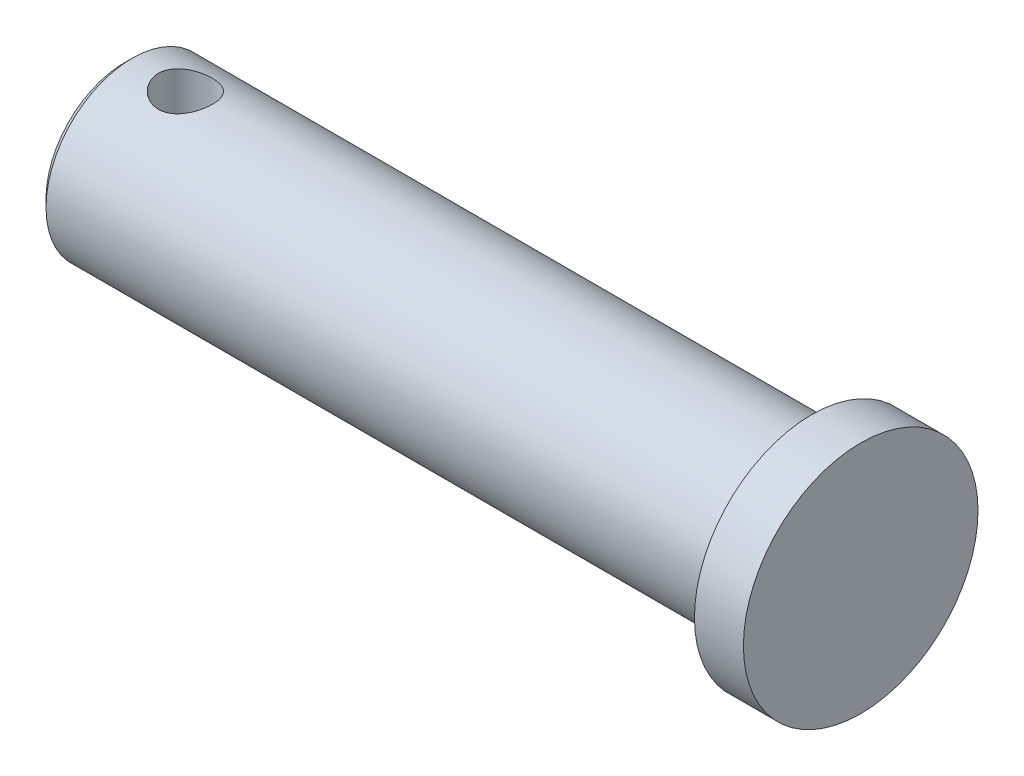
ISO-10303-21;
HEADER;
FILE_DESCRIPTION(('STEP AP214'),'2;1');
FILE_NAME('part.step','',(''),(''),'','','');
FILE_SCHEMA(('AUTOMOTIVE_DESIGN { 1 0 10303 214 1 1 1 1 }'));
ENDSEC;
DATA;
#1=APPLICATION_CONTEXT('core data for automotive mechanical design processes');
#2=APPLICATION_PROTOCOL_DEFINITION('international standard','automotive_design',2000,#1);
#3=PRODUCT_CONTEXT('',#1,'mechanical');
#4=PRODUCT('Part','Part','',(#3));
#5=PRODUCT_RELATED_PRODUCT_CATEGORY('part','',(#4));
#6=PRODUCT_DEFINITION_FORMATION('','',#4);
#7=PRODUCT_DEFINITION_CONTEXT('part definition',#1,'design');
#8=PRODUCT_DEFINITION('design','',#6,#7);
#9=PRODUCT_DEFINITION_SHAPE('','',#8);
#10=(LENGTH_UNIT() NAMED_UNIT(*) SI_UNIT(.MILLI.,.METRE.));
#11=(NAMED_UNIT(*) PLANE_ANGLE_UNIT() SI_UNIT($,.RADIAN.));
#12=(NAMED_UNIT(*) SI_UNIT($,.STERADIAN.) SOLID_ANGLE_UNIT());
#13=UNCERTAINTY_MEASURE_WITH_UNIT(LENGTH_MEASURE(1.E-05),#10,'distance_accuracy_value','');
#14=(GEOMETRIC_REPRESENTATION_CONTEXT(3) GLOBAL_UNCERTAINTY_ASSIGNED_CONTEXT((#13)) GLOBAL_UNIT_ASSIGNED_CONTEXT((#10,
#11,#12)) REPRESENTATION_CONTEXT('',''));
#15=CARTESIAN_POINT('',(0.,0.,0.));
#16=DIRECTION('',(0.,0.,1.));
#17=DIRECTION('',(1.,0.,0.));
#18=AXIS2_PLACEMENT_3D('',#15,#16,#17);
#19=CARTESIAN_POINT('',(24.6253,0.,0.));
#20=DIRECTION('',(1.,0.,0.));
#21=DIRECTION('',(0.,1.,0.));
#22=AXIS2_PLACEMENT_3D('',#19,#20,#21);
#23=PLANE('',#22);
#24=CARTESIAN_POINT('',(24.6253,0.,0.));
#25=DIRECTION('',(1.,0.,0.));
#26=DIRECTION('',(0.,0.,-1.));
#27=AXIS2_PLACEMENT_3D('',#24,#25,#26);
#28=CIRCLE('',#27,7.8486);
#29=CARTESIAN_POINT('',(24.6253,0.,-7.8486));
#30=VERTEX_POINT('',#29);
#31=EDGE_CURVE('E10',#30,#30,#28,.T.);
#32=ORIENTED_EDGE('',*,*,#31,.T.);
#33=EDGE_LOOP('',(#32));
#34=FACE_BOUND('',#33,.T.);
#35=ADVANCED_FACE('F15',(#34),#23,.T.);
#36=CARTESIAN_POINT('',(24.6253,0.,0.));
#37=DIRECTION('',(-1.,0.,0.));
#38=DIRECTION('',(0.,0.,-1.));
#39=AXIS2_PLACEMENT_3D('',#36,#37,#38);
#40=CYLINDRICAL_SURFACE('',#39,7.8486);
#41=ORIENTED_EDGE('',*,*,#31,.F.);
#42=EDGE_LOOP('',(#41));
#43=FACE_BOUND('',#42,.T.);
#44=CARTESIAN_POINT('',(21.3487,0.,0.));
#45=DIRECTION('',(-1.,0.,0.));
#46=DIRECTION('',(0.,0.,-1.));
#47=AXIS2_PLACEMENT_3D('',#44,#45,#46);
#48=CIRCLE('',#47,7.8486);
#49=CARTESIAN_POINT('',(21.3487,0.,-7.8486));
#50=VERTEX_POINT('',#49);
#51=EDGE_CURVE('E29',#50,#50,#48,.T.);
#52=ORIENTED_EDGE('',*,*,#51,.F.);
#53=EDGE_LOOP('',(#52));
#54=FACE_BOUND('',#53,.T.);
#55=ADVANCED_FACE('F17',(#43,#54),#40,.T.);
#56=CARTESIAN_POINT('',(21.3487,0.,0.));
#57=DIRECTION('',(1.,0.,0.));
#58=DIRECTION('',(0.,1.,0.));
#59=AXIS2_PLACEMENT_3D('',#56,#57,#58);
#60=PLANE('',#59);
#61=CARTESIAN_POINT('',(21.3487,0.,0.));
#62=DIRECTION('',(-1.,0.,0.));
#63=DIRECTION('',(0.,1.,0.));
#64=AXIS2_PLACEMENT_3D('',#61,#62,#63);
#65=CIRCLE('',#64,5.77215);
#66=CARTESIAN_POINT('',(21.3487,5.77215,0.));
#67=VERTEX_POINT('',#66);
#68=EDGE_CURVE('E83',#67,#67,#65,.T.);
#69=ORIENTED_EDGE('',*,*,#68,.F.);
#70=EDGE_LOOP('',(#69));
#71=FACE_BOUND('',#70,.T.);
#72=ORIENTED_EDGE('',*,*,#51,.T.);
#73=EDGE_LOOP('',(#72));
#74=FACE_BOUND('',#73,.T.);
#75=ADVANCED_FACE('F72',(#71,#74),#60,.F.);
#76=CARTESIAN_POINT('',(-20.5613,0.,0.));
#77=DIRECTION('',(0.,1.,0.));
#78=DIRECTION('',(-1.,0.,0.));
#79=AXIS2_PLACEMENT_3D('',#76,#77,#78);
#80=CYLINDRICAL_SURFACE('',#79,1.8034);
#81=CARTESIAN_POINT('',(-20.5613,5.48319834243665,1.8034));
#82=CARTESIAN_POINT('',(-20.6598484350121,5.48320186402566,1.80339569706664));
#83=CARTESIAN_POINT('',(-20.7584482747342,5.48588634940909,1.79528950068061));
#84=CARTESIAN_POINT('',(-20.9527942611156,5.4962972327243,1.76315204510736));
#85=CARTESIAN_POINT('',(-21.0485376661121,5.50402832137474,1.73910596979291));
#86=CARTESIAN_POINT('',(-21.2342622721237,5.52356979180081,1.67599906269568));
#87=CARTESIAN_POINT('',(-21.3242547756247,5.53537186093526,1.63696880928761));
#88=CARTESIAN_POINT('',(-21.4964262003889,5.56171493018406,1.54509455265946));
#89=CARTESIAN_POINT('',(-21.578604730652,5.57625606724904,1.49224985868003));
#90=CARTESIAN_POINT('',(-21.7356568773243,5.60700064792938,1.37229805973743));
#91=CARTESIAN_POINT('',(-21.8102226945773,5.62324179390229,1.30479750573415));
#92=CARTESIAN_POINT('',(-21.94718301652,5.65523582424643,1.15829102401291));
#93=CARTESIAN_POINT('',(-22.0095756059842,5.67098863145946,1.07928328926865));
#94=CARTESIAN_POINT('',(-22.1217722571299,5.70066112340364,0.909798784990392));
#95=CARTESIAN_POINT('',(-22.171259998111,5.71453134153621,0.819103193693785));
#96=CARTESIAN_POINT('',(-22.2541594351722,5.73843650375973,0.630169049287837));
#97=CARTESIAN_POINT('',(-22.2875749063219,5.74847234835786,0.531932273751014));
#98=CARTESIAN_POINT('',(-22.3363553051646,5.76331157507023,0.333921760949439));
#99=CARTESIAN_POINT('',(-22.3522454307021,5.76826686794795,0.234289000039592));
#100=CARTESIAN_POINT('',(-22.3671880869279,5.77292317491054,0.0336566824371415));
#101=CARTESIAN_POINT('',(-22.36624446551,5.77262538975538,-0.0673425566287077));
#102=CARTESIAN_POINT('',(-22.3478920048015,5.76691489411507,-0.264144582768769));
#103=CARTESIAN_POINT('',(-22.3310525071741,5.76167905534082,-0.360006415014054));
#104=CARTESIAN_POINT('',(-22.2823204536469,5.74689827269614,-0.547468309881209));
#105=CARTESIAN_POINT('',(-22.2504269057459,5.73735304485615,-0.639068091214047));
#106=CARTESIAN_POINT('',(-22.1721261557346,5.71478851826806,-0.816719490464581));
#107=CARTESIAN_POINT('',(-22.1255461405379,5.70172814010789,-0.902689507270451));
#108=CARTESIAN_POINT('',(-22.0193333465694,5.67350942012243,-1.06577002862383));
#109=CARTESIAN_POINT('',(-21.9596972739903,5.65835054924082,-1.14287829001131));
#110=CARTESIAN_POINT('',(-21.8261419977313,5.62680311816792,-1.28944139387536));
#111=CARTESIAN_POINT('',(-21.7517312889115,5.61038963808177,-1.35844361214182));
#112=CARTESIAN_POINT('',(-21.5922409268402,5.57872787733139,-1.48312491937426));
#113=CARTESIAN_POINT('',(-21.5071600123959,5.56347973475074,-1.53880243112543));
#114=CARTESIAN_POINT('',(-21.3274659736809,5.53574945475998,-1.63578013234805));
#115=CARTESIAN_POINT('',(-21.2327569750938,5.52330012222187,-1.67691274963387));
#116=CARTESIAN_POINT('',(-21.0372742988197,5.50296192800438,-1.7425035335905));
#117=CARTESIAN_POINT('',(-20.9365028216164,5.49507142251405,-1.76696771109863));
#118=CARTESIAN_POINT('',(-20.7360918679955,5.48510770008715,-1.79765417882356));
#119=CARTESIAN_POINT('',(-20.6365694304939,5.48281360677003,-1.80456954423554));
#120=CARTESIAN_POINT('',(-20.4377792663776,5.4836892285396,-1.80190769162034));
#121=CARTESIAN_POINT('',(-20.3385115029665,5.48685810392785,-1.79233300823505));
#122=CARTESIAN_POINT('',(-20.1460327000649,5.49808452005514,-1.75758233390414));
#123=CARTESIAN_POINT('',(-20.0527295287442,5.50599810082784,-1.73286531591731));
#124=CARTESIAN_POINT('',(-19.8716039421823,5.52566990223878,-1.66906995193949));
#125=CARTESIAN_POINT('',(-19.7837824936551,5.53742879873856,-1.62998908117489));
#126=CARTESIAN_POINT('',(-19.6133245459759,5.56388535576388,-1.5372949118933));
#127=CARTESIAN_POINT('',(-19.5309093286743,5.57865770326776,-1.48329655962147));
#128=CARTESIAN_POINT('',(-19.3760658813998,5.60932019533311,-1.36275562392787));
#129=CARTESIAN_POINT('',(-19.3036392462615,5.62521051778666,-1.29621104130833));
#130=CARTESIAN_POINT('',(-19.1677396668058,5.65711290449366,-1.14920285296442));
#131=CARTESIAN_POINT('',(-19.1047583859149,5.67310302505024,-1.06827883419905));
#132=CARTESIAN_POINT('',(-18.9932155836113,5.70275821114271,-0.896573224528751));
#133=CARTESIAN_POINT('',(-18.9446613542211,5.71642209942071,-0.805786680249533));
#134=CARTESIAN_POINT('',(-18.8638237546815,5.73980824682996,-0.617466312492404));
#135=CARTESIAN_POINT('',(-18.8314376135832,5.7495553234427,-0.519979706906438));
#136=CARTESIAN_POINT('',(-18.7837158384193,5.76409039090711,-0.320749262323173));
#137=CARTESIAN_POINT('',(-18.768332671699,5.76889220390645,-0.219018120728599));
#138=CARTESIAN_POINT('',(-18.7591592637986,5.77175746971106,-0.0779345284266444));
#139=CARTESIAN_POINT('',(-18.7578960586544,5.77215246519324,-0.0389784234385013));
#140=CARTESIAN_POINT('',(-18.7579099648231,5.77214376730263,0.0985483463508575));
#141=CARTESIAN_POINT('',(-18.7660197795066,5.76959688770933,0.197239356630831));
#142=CARTESIAN_POINT('',(-18.7982197743731,5.75966091069413,0.39189336158431));
#143=CARTESIAN_POINT('',(-18.8223499703016,5.75225968864568,0.487848896048239));
#144=CARTESIAN_POINT('',(-18.8856931541845,5.73342944548577,0.673963339065578));
#145=CARTESIAN_POINT('',(-18.924869656252,5.72201017334315,0.764135658837079));
#146=CARTESIAN_POINT('',(-19.0170727789015,5.69632765619702,0.936577042129126));
#147=CARTESIAN_POINT('',(-19.0700940931172,5.68206550129304,1.01884911712539));
#148=CARTESIAN_POINT('',(-19.1902220774446,5.65171245363126,1.17576813836587));
#149=CARTESIAN_POINT('',(-19.2576810691606,5.635581584061,1.25013762923588));
#150=CARTESIAN_POINT('',(-19.4040419474517,5.60353634333792,1.3867337584804));
#151=CARTESIAN_POINT('',(-19.482949126066,5.58762207605346,1.4489547497153));
#152=CARTESIAN_POINT('',(-19.652362764802,5.55738426960572,1.5609785599755));
#153=CARTESIAN_POINT('',(-19.743110342898,5.543110586423,1.61043111685007));
#154=CARTESIAN_POINT('',(-19.9320965750075,5.51839034612604,1.69321225998982));
#155=CARTESIAN_POINT('',(-20.0303258334873,5.50793908150756,1.72656069563934));
#156=CARTESIAN_POINT('',(-20.2010611629469,5.49457094040421,1.76853683534519));
#157=CARTESIAN_POINT('',(-20.2724075409738,5.49033300765737,1.78158445352013));
#158=CARTESIAN_POINT('',(-20.4162600543538,5.48464551589845,1.79901729874317));
#159=CARTESIAN_POINT('',(-20.4887661034508,5.48319575046679,1.80340316705712));
#160=CARTESIAN_POINT('',(-20.5613,5.48319834243665,1.8034));
#161=B_SPLINE_CURVE_WITH_KNOTS('',3,(#81,#82,#83,#84,#85,#86,#87,#88,#89,#90,#91,#92,#93,#94,
#95,#96,#97,#98,#99,#100,#101,#102,#103,#104,#105,#106,#107,#108,#109,#110,#111,#112,#113,#114,
#115,#116,#117,#118,#119,#120,#121,#122,#123,#124,#125,#126,#127,#128,#129,#130,#131,#132,#133,
#134,#135,#136,#137,#138,#139,#140,#141,#142,#143,#144,#145,#146,#147,#148,#149,#150,#151,#152,
#153,#154,#155,#156,#157,#158,#159,#160),.UNSPECIFIED.,.T.,.F.,(4,2,2,2,2,2,2,2,2,2,2,2,2,2,2,2,
2,2,2,2,2,2,2,2,2,2,2,2,2,2,2,2,2,2,2,2,2,2,2,4),(0.,0.29537255111942,0.591020036901092,
0.886067371440743,1.18112946196707,1.48539487841412,1.78970812669905,2.10089791299547,
2.41201457101192,2.71353053966233,3.01497758803153,3.30602164044615,3.59708487416891,
3.8917095386705,4.1864086174785,4.4933839619325,4.80039562439879,5.11083720998194,
5.42116678730798,5.71903472129273,6.01685687486927,6.30607015601247,6.59533429729427,
6.89290417044643,7.19052150044994,7.5003973034153,7.81042946490429,8.1184650126517,
8.42563723654724,8.54252812876897,8.83806096759973,9.13433478030575,9.42989464705139,
9.72534139903225,10.029047383143,10.3328942083565,10.6443551954133,10.9554313002858,
11.1728483337302,11.3902492702719),.UNSPECIFIED.);
#162=CARTESIAN_POINT('',(-20.5613,5.48319834243665,1.8034));
#163=VERTEX_POINT('',#162);
#164=EDGE_CURVE('E39',#163,#163,#161,.T.);
#165=ORIENTED_EDGE('',*,*,#164,.F.);
#166=EDGE_LOOP('',(#165));
#167=FACE_BOUND('',#166,.T.);
#168=CARTESIAN_POINT('',(-18.7579,-5.77215,0.));
#169=CARTESIAN_POINT('',(-18.7579041985986,-5.77214707854961,-0.0986807837604178));
#170=CARTESIAN_POINT('',(-18.7660314363298,-5.76959359020854,-0.197412722104755));
#171=CARTESIAN_POINT('',(-18.7982600825031,-5.75964816781203,-0.392033645508827));
#172=CARTESIAN_POINT('',(-18.8223758360842,-5.75225188880534,-0.487919996675216));
#173=CARTESIAN_POINT('',(-18.8856862339525,-5.73343161311732,-0.67394789522238));
#174=CARTESIAN_POINT('',(-18.9248534493683,-5.72201494609389,-0.764099546875964));
#175=CARTESIAN_POINT('',(-19.0170510257445,-5.69633345778552,-0.936542160913324));
#176=CARTESIAN_POINT('',(-19.0700817683271,-5.68206855809965,-1.01883290682425));
#177=CARTESIAN_POINT('',(-19.1902301337677,-5.65171047694741,-1.17577877600688));
#178=CARTESIAN_POINT('',(-19.2576992472142,-5.63557741390101,-1.25015708817755));
#179=CARTESIAN_POINT('',(-19.4040617822753,-5.6035321901842,-1.38674977448695));
#180=CARTESIAN_POINT('',(-19.482957540938,-5.58762007543483,-1.44896165413939));
#181=CARTESIAN_POINT('',(-19.6523235979786,-5.55739177130346,-1.56095128790402));
#182=CARTESIAN_POINT('',(-19.7430316087281,-5.543124695063,-1.61038405565675));
#183=CARTESIAN_POINT('',(-19.9319910381115,-5.51840035566365,-1.69317857435157));
#184=CARTESIAN_POINT('',(-20.0302404522984,-5.50794208437006,-1.72654457868426));
#185=CARTESIAN_POINT('',(-20.2283763129997,-5.49243580520019,-1.77524767470074));
#186=CARTESIAN_POINT('',(-20.3281244490627,-5.4872344105094,-1.79109725090201));
#187=CARTESIAN_POINT('',(-20.5289893474291,-5.48237538967296,-1.80591863991193));
#188=CARTESIAN_POINT('',(-20.6301057400548,-5.48271629484457,-1.80489492406062));
#189=CARTESIAN_POINT('',(-20.8265974994125,-5.48876796085035,-1.78639963667636));
#190=CARTESIAN_POINT('',(-20.9220418430599,-5.49426601626626,-1.76957954938897));
#191=CARTESIAN_POINT('',(-21.1086800877588,-5.50966699464714,-1.72102509728805));
#192=CARTESIAN_POINT('',(-21.1998735159202,-5.51957040639701,-1.68928907749375));
#193=CARTESIAN_POINT('',(-21.3769752368588,-5.54282959157607,-1.61134250666078));
#194=CARTESIAN_POINT('',(-21.4627866901732,-5.55623375303235,-1.56492698731734));
#195=CARTESIAN_POINT('',(-21.6256117184265,-5.58496095995788,-1.45908406732531));
#196=CARTESIAN_POINT('',(-21.7026235046245,-5.60028439424257,-1.39965402830239));
#197=CARTESIAN_POINT('',(-21.8493402700678,-5.63197512245456,-1.26628240373663));
#198=CARTESIAN_POINT('',(-21.9185555898611,-5.64835824303679,-1.19180500114691));
#199=CARTESIAN_POINT('',(-22.0436585868422,-5.67971594969054,-1.03206495164036));
#200=CARTESIAN_POINT('',(-22.0995405028124,-5.69468992519974,-0.946797666797823));
#201=CARTESIAN_POINT('',(-22.196723670822,-5.72170181137401,-0.766930068381983));
#202=CARTESIAN_POINT('',(-22.2378969767407,-5.73371368916321,-0.672256598326991));
#203=CARTESIAN_POINT('',(-22.3035161712119,-5.75324150640682,-0.476970549518446));
#204=CARTESIAN_POINT('',(-22.3279964786241,-5.76076669280125,-0.376370658735173));
#205=CARTESIAN_POINT('',(-22.3506861200555,-5.76778411178924,-0.229052655300026));
#206=CARTESIAN_POINT('',(-22.3559352095,-5.76941665695851,-0.183423067156375));
#207=CARTESIAN_POINT('',(-22.3629434209612,-5.77160046624104,-0.0918699623392746));
#208=CARTESIAN_POINT('',(-22.364702530077,-5.77215172635721,-0.0459464445799106));
#209=CARTESIAN_POINT('',(-22.3646945700554,-5.7721462949649,0.0986083257860243));
#210=CARTESIAN_POINT('',(-22.3565750409042,-5.76959553765983,0.197322252365377));
#211=CARTESIAN_POINT('',(-22.3243602216361,-5.75965448682943,0.391962472413403));
#212=CARTESIAN_POINT('',(-22.3002373621934,-5.75225584200185,0.487883656554894));
#213=CARTESIAN_POINT('',(-22.2369103854761,-5.7334305784925,0.673955392699601));
#214=CARTESIAN_POINT('',(-22.1977383905317,-5.72201254350189,0.764117762046372));
#215=CARTESIAN_POINT('',(-22.1055378901816,-5.69633049961576,0.936559936827055));
#216=CARTESIAN_POINT('',(-22.0525118867273,-5.68206700470322,1.01884116188575));
#217=CARTESIAN_POINT('',(-21.9323765148966,-5.65171210569701,1.17577012513113));
#218=CARTESIAN_POINT('',(-21.8649157740703,-5.63558083152966,1.25014114532033));
#219=CARTESIAN_POINT('',(-21.7185543547728,-5.60353559500219,1.38673663932415));
#220=CARTESIAN_POINT('',(-21.6396489170468,-5.58762172607693,1.4489560345265));
#221=CARTESIAN_POINT('',(-21.4702375800396,-5.55738433187375,1.56097834135031));
#222=CARTESIAN_POINT('',(-21.3794903803354,-5.54311070011238,1.61043072565556));
#223=CARTESIAN_POINT('',(-21.1905042053212,-5.51839042921121,1.69321199237652));
#224=CARTESIAN_POINT('',(-21.0922745653214,-5.50793911275447,1.72656059690152));
#225=CARTESIAN_POINT('',(-20.9215388464637,-5.49457094112621,1.76853683351291));
#226=CARTESIAN_POINT('',(-20.8501924784886,-5.49033300880896,1.78158445022611));
#227=CARTESIAN_POINT('',(-20.7063399655247,-5.48464551629987,1.79901729726941));
#228=CARTESIAN_POINT('',(-20.633833906474,-5.48319575044925,1.80340316650189));
#229=CARTESIAN_POINT('',(-20.4627515554535,-5.48320186404935,1.80339569782119));
#230=CARTESIAN_POINT('',(-20.3641517062544,-5.48588635004733,1.79528950216858));
#231=CARTESIAN_POINT('',(-20.1698057203238,-5.4962972341004,1.76315203740021));
#232=CARTESIAN_POINT('',(-20.0740623246875,-5.50402832190247,1.73910595521505));
#233=CARTESIAN_POINT('',(-19.8883366190627,-5.52356990890679,1.67599869736317));
#234=CARTESIAN_POINT('',(-19.798343073486,-5.53537214466747,1.63696791899717));
#235=CARTESIAN_POINT('',(-19.6261718199552,-5.56171527855347,1.54509323867316));
#236=CARTESIAN_POINT('',(-19.5439943160578,-5.57625624815056,1.49224897621556));
#237=CARTESIAN_POINT('',(-19.3869502348079,-5.6069992615487,1.37230365094652));
#238=CARTESIAN_POINT('',(-19.3123906577621,-5.62323890957285,1.30481018282987));
#239=CARTESIAN_POINT('',(-19.1754280431627,-5.65523300542542,1.15830446066148));
#240=CARTESIAN_POINT('',(-19.1130290850346,-5.67098728894547,1.07928835669052));
#241=CARTESIAN_POINT('',(-19.0008010480733,-5.70066828756871,0.909760525030074));
#242=CARTESIAN_POINT('',(-18.9512939562784,-5.71454465594434,0.819026263317234));
#243=CARTESIAN_POINT('',(-18.8684075776855,-5.73844598289125,0.630065871345101));
#244=CARTESIAN_POINT('',(-18.8350092638219,-5.74847548235246,0.531848739206306));
#245=CARTESIAN_POINT('',(-18.7929086027009,-5.76128556100838,0.360985554057298));
#246=CARTESIAN_POINT('',(-18.7798060437639,-5.76533743914582,0.289488278086654));
#247=CARTESIAN_POINT('',(-18.7623004678158,-5.77077065114186,0.145336536633036));
#248=CARTESIAN_POINT('',(-18.7578969075728,-5.77215215175913,0.0726821436949411));
#249=CARTESIAN_POINT('',(-18.7579,-5.77215,0.));
#250=B_SPLINE_CURVE_WITH_KNOTS('',3,(#168,#169,#170,#171,#172,#173,#174,#175,#176,#177,#178,
#179,#180,#181,#182,#183,#184,#185,#186,#187,#188,#189,#190,#191,#192,#193,#194,#195,#196,#197,
#198,#199,#200,#201,#202,#203,#204,#205,#206,#207,#208,#209,#210,#211,#212,#213,#214,#215,#216,
#217,#218,#219,#220,#221,#222,#223,#224,#225,#226,#227,#228,#229,#230,#231,#232,#233,#234,#235,
#236,#237,#238,#239,#240,#241,#242,#243,#244,#245,#246,#247,#248,#249),.UNSPECIFIED.,.T.,.F.,(4,
2,2,2,2,2,2,2,2,2,2,2,2,2,2,2,2,2,2,2,2,2,2,2,2,2,2,2,2,2,2,2,2,2,2,2,2,2,2,2,4),(0.,
0.295770454802949,0.591806639118594,0.887305883898141,1.18281326376226,1.48655856275088,
1.7903660735625,2.10167583947238,2.41290314627317,2.71476165283929,3.01654016966106,
3.30639484387734,3.59628168619269,3.89040954287873,4.18459708205614,4.49212420609435,
4.79978396956695,5.11005830633829,5.41969094624781,5.55744730803783,5.6952041790587,
5.9908521784,6.28701082492808,6.58254080281411,6.87801744659277,7.18173052003292,
7.48557025600807,7.79703000920732,8.1081073477852,8.32552435156582,8.54292531777067,
8.83829789735274,9.13394535466975,9.42899621657308,9.72405477938191,10.0282931687495,
10.3326334435164,10.6439709971955,10.9549399049205,11.1727996791862,11.3906458481921),.UNSPECIFIED.);
#251=CARTESIAN_POINT('',(-18.7579,-5.77215,0.));
#252=VERTEX_POINT('',#251);
#253=EDGE_CURVE('E19',#252,#252,#250,.T.);
#254=ORIENTED_EDGE('',*,*,#253,.F.);
#255=EDGE_LOOP('',(#254));
#256=FACE_BOUND('',#255,.T.);
#257=ADVANCED_FACE('F47',(#167,#256),#80,.F.);
#258=CARTESIAN_POINT('',(0.,0.,0.));
#259=DIRECTION('',(1.,0.,0.));
#260=DIRECTION('',(0.,1.,0.));
#261=AXIS2_PLACEMENT_3D('',#258,#259,#260);
#262=CYLINDRICAL_SURFACE('',#261,5.77215);
#263=ORIENTED_EDGE('',*,*,#253,.T.);
#264=EDGE_LOOP('',(#263));
#265=FACE_BOUND('',#264,.T.);
#266=CARTESIAN_POINT('',(-24.1173,0.,0.));
#267=DIRECTION('',(-1.,0.,0.));
#268=DIRECTION('',(0.,-1.,0.));
#269=AXIS2_PLACEMENT_3D('',#266,#267,#268);
#270=CIRCLE('',#269,5.77215);
#271=CARTESIAN_POINT('',(-24.1173,-5.77215,0.));
#272=VERTEX_POINT('',#271);
#273=EDGE_CURVE('E88',#272,#272,#270,.T.);
#274=ORIENTED_EDGE('',*,*,#273,.F.);
#275=EDGE_LOOP('',(#274));
#276=FACE_BOUND('',#275,.T.);
#277=ORIENTED_EDGE('',*,*,#164,.T.);
#278=EDGE_LOOP('',(#277));
#279=FACE_BOUND('',#278,.T.);
#280=ORIENTED_EDGE('',*,*,#68,.T.);
#281=EDGE_LOOP('',(#280));
#282=FACE_BOUND('',#281,.T.);
#283=ADVANCED_FACE('F50',(#265,#276,#279,#282),#262,.T.);
#284=CARTESIAN_POINT('',(-24.6253,0.,0.));
#285=DIRECTION('',(1.,0.,0.));
#286=DIRECTION('',(0.,1.,0.));
#287=AXIS2_PLACEMENT_3D('',#284,#285,#286);
#288=PLANE('',#287);
#289=CARTESIAN_POINT('',(-24.6253,0.,0.));
#290=DIRECTION('',(1.,0.,0.));
#291=DIRECTION('',(0.,-1.,0.));
#292=AXIS2_PLACEMENT_3D('',#289,#290,#291);
#293=CIRCLE('',#292,5.26415);
#294=CARTESIAN_POINT('',(-24.6253,-5.26415,0.));
#295=VERTEX_POINT('',#294);
#296=EDGE_CURVE('E97',#295,#295,#293,.T.);
#297=ORIENTED_EDGE('',*,*,#296,.F.);
#298=EDGE_LOOP('',(#297));
#299=FACE_BOUND('',#298,.T.);
#300=ADVANCED_FACE('F54',(#299),#288,.F.);
#301=CARTESIAN_POINT('',(-24.3713,0.,0.));
#302=DIRECTION('',(1.,0.,0.));
#303=DIRECTION('',(0.,-1.,0.));
#304=AXIS2_PLACEMENT_3D('',#301,#302,#303);
#305=CONICAL_SURFACE('',#304,5.51815,0.785398163397446);
#306=ORIENTED_EDGE('',*,*,#273,.T.);
#307=EDGE_LOOP('',(#306));
#308=FACE_BOUND('',#307,.T.);
#309=ORIENTED_EDGE('',*,*,#296,.T.);
#310=EDGE_LOOP('',(#309));
#311=FACE_BOUND('',#310,.T.);
#312=ADVANCED_FACE('F59',(#308,#311),#305,.T.);
#313=CLOSED_SHELL('',(#35,#55,#75,#257,#283,#300,#312));
#314=MANIFOLD_SOLID_BREP('B1',#313);
#315=ADVANCED_BREP_SHAPE_REPRESENTATION('',(#18,#314),#14);
#316=SHAPE_DEFINITION_REPRESENTATION(#9,#315);
ENDSEC;
END-ISO-10303-21;
